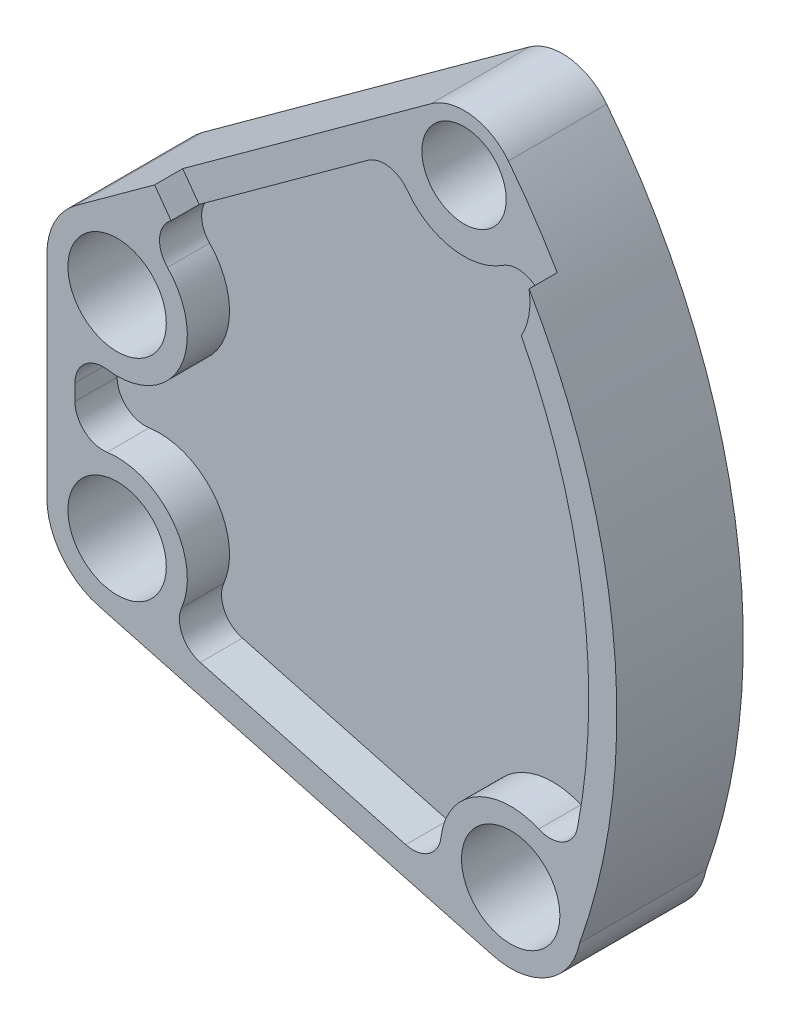
ISO-10303-21;
HEADER;
FILE_DESCRIPTION(('STEP AP214'),'2;1');
FILE_NAME('part.step','',(''),(''),'','','');
FILE_SCHEMA(('AUTOMOTIVE_DESIGN { 1 0 10303 214 1 1 1 1 }'));
ENDSEC;
DATA;
#1=APPLICATION_CONTEXT('core data for automotive mechanical design processes');
#2=APPLICATION_PROTOCOL_DEFINITION('international standard','automotive_design',2000,#1);
#3=PRODUCT_CONTEXT('',#1,'mechanical');
#4=PRODUCT('Part','Part','',(#3));
#5=PRODUCT_RELATED_PRODUCT_CATEGORY('part','',(#4));
#6=PRODUCT_DEFINITION_FORMATION('','',#4);
#7=PRODUCT_DEFINITION_CONTEXT('part definition',#1,'design');
#8=PRODUCT_DEFINITION('design','',#6,#7);
#9=PRODUCT_DEFINITION_SHAPE('','',#8);
#10=(LENGTH_UNIT() NAMED_UNIT(*) SI_UNIT(.MILLI.,.METRE.));
#11=(NAMED_UNIT(*) PLANE_ANGLE_UNIT() SI_UNIT($,.RADIAN.));
#12=(NAMED_UNIT(*) SI_UNIT($,.STERADIAN.) SOLID_ANGLE_UNIT());
#13=UNCERTAINTY_MEASURE_WITH_UNIT(LENGTH_MEASURE(1.E-05),#10,'distance_accuracy_value','');
#14=(GEOMETRIC_REPRESENTATION_CONTEXT(3) GLOBAL_UNCERTAINTY_ASSIGNED_CONTEXT((#13)) GLOBAL_UNIT_ASSIGNED_CONTEXT((#10,
#11,#12)) REPRESENTATION_CONTEXT('',''));
#15=CARTESIAN_POINT('',(0.,0.,0.));
#16=DIRECTION('',(0.,0.,1.));
#17=DIRECTION('',(1.,0.,0.));
#18=AXIS2_PLACEMENT_3D('',#15,#16,#17);
#19=CARTESIAN_POINT('',(-22.6524758424985,-16.4579870641893,14.));
#20=DIRECTION('',(0.,0.,1.));
#21=DIRECTION('',(-1.,0.,0.));
#22=AXIS2_PLACEMENT_3D('',#19,#20,#21);
#23=PLANE('',#22);
#24=CARTESIAN_POINT('',(-22.6524758424985,-16.4579870641893,14.));
#25=DIRECTION('',(0.,0.,1.));
#26=DIRECTION('',(1.,0.,0.));
#27=AXIS2_PLACEMENT_3D('',#24,#25,#26);
#28=CIRCLE('',#27,3.49999999999999);
#29=CARTESIAN_POINT('',(-19.1524758424986,-16.4579870641893,14.));
#30=VERTEX_POINT('',#29);
#31=EDGE_CURVE('E502',#30,#30,#28,.T.);
#32=ORIENTED_EDGE('',*,*,#31,.F.);
#33=EDGE_LOOP('',(#32));
#34=FACE_BOUND('',#33,.T.);
#35=CARTESIAN_POINT('',(-22.6524758424985,-31.4579870641893,14.));
#36=DIRECTION('',(0.,0.,1.));
#37=DIRECTION('',(1.,0.,0.));
#38=AXIS2_PLACEMENT_3D('',#35,#36,#37);
#39=CIRCLE('',#38,3.49999999999999);
#40=CARTESIAN_POINT('',(-19.1524758424986,-31.4579870641893,14.));
#41=VERTEX_POINT('',#40);
#42=EDGE_CURVE('E496',#41,#41,#39,.T.);
#43=ORIENTED_EDGE('',*,*,#42,.F.);
#44=EDGE_LOOP('',(#43));
#45=FACE_BOUND('',#44,.T.);
#46=DIRECTION('',(0.,1.,0.));
#47=VECTOR('',#46,1.);
#48=CARTESIAN_POINT('',(-27.6524758424986,-35.294622004084,14.));
#49=LINE('',#48,#47);
#50=CARTESIAN_POINT('',(-27.6524758424986,-31.4579870641893,14.));
#51=VERTEX_POINT('',#50);
#52=CARTESIAN_POINT('',(-27.6524758424986,-16.4579870641893,14.));
#53=VERTEX_POINT('',#52);
#54=EDGE_CURVE('E257',#51,#53,#49,.T.);
#55=ORIENTED_EDGE('',*,*,#54,.F.);
#56=CARTESIAN_POINT('',(-22.6524758424986,-31.4579870641893,14.));
#57=DIRECTION('',(0.,0.,-1.));
#58=DIRECTION('',(-1.,0.,0.));
#59=AXIS2_PLACEMENT_3D('',#56,#57,#58);
#60=CIRCLE('',#59,5.);
#61=CARTESIAN_POINT('',(-23.9465710680112,-36.2876161956346,14.));
#62=VERTEX_POINT('',#61);
#63=EDGE_CURVE('E388',#62,#51,#60,.T.);
#64=ORIENTED_EDGE('',*,*,#63,.F.);
#65=DIRECTION('',(-0.965925826289068,0.258819045102521,0.));
#66=VECTOR('',#65,1.);
#67=CARTESIAN_POINT('',(4.06527789437187,-43.7933685036077,14.));
#68=LINE('',#67,#66);
#69=CARTESIAN_POINT('',(4.06527789437187,-43.7933685036077,14.));
#70=VERTEX_POINT('',#69);
#71=EDGE_CURVE('E292',#70,#62,#68,.T.);
#72=ORIENTED_EDGE('',*,*,#71,.F.);
#73=CARTESIAN_POINT('',(5.35937311988446,-38.9637393721623,14.));
#74=DIRECTION('',(0.,0.,-1.));
#75=DIRECTION('',(-1.,0.,0.));
#76=AXIS2_PLACEMENT_3D('',#73,#74,#75);
#77=CIRCLE('',#76,5.00000000000001);
#78=CARTESIAN_POINT('',(10.2601455915492,-39.9549150281252,14.));
#79=VERTEX_POINT('',#78);
#80=EDGE_CURVE('E289',#79,#70,#77,.T.);
#81=ORIENTED_EDGE('',*,*,#80,.F.);
#82=CARTESIAN_POINT('',(-33.086664591222,-24.5583554455818,14.));
#83=DIRECTION('',(0.,0.,-1.));
#84=DIRECTION('',(-1.,0.,0.));
#85=AXIS2_PLACEMENT_3D('',#82,#83,#84);
#86=CIRCLE('',#85,46.);
#87=CARTESIAN_POINT('',(6.67035341824604,-1.42008586908067,14.));
#88=VERTEX_POINT('',#87);
#89=EDGE_CURVE('E286',#88,#79,#86,.T.);
#90=ORIENTED_EDGE('',*,*,#89,.F.);
#91=CARTESIAN_POINT('',(1.73025928211613,-2.1917528478837,14.));
#92=DIRECTION('',(0.,0.,1.));
#93=DIRECTION('',(1.,0.,0.));
#94=AXIS2_PLACEMENT_3D('',#91,#92,#93);
#95=CIRCLE('',#94,5.00000000000001);
#96=CARTESIAN_POINT('',(6.11949722855625,-4.58645329878153,14.));
#97=VERTEX_POINT('',#96);
#98=EDGE_CURVE('E284',#97,#88,#95,.T.);
#99=ORIENTED_EDGE('',*,*,#98,.F.);
#100=CARTESIAN_POINT('',(-33.086664591222,-24.5583554455818,14.));
#101=DIRECTION('',(0.,0.,1.));
#102=DIRECTION('',(1.,0.,0.));
#103=AXIS2_PLACEMENT_3D('',#100,#101,#102);
#104=CIRCLE('',#103,44.);
#105=CARTESIAN_POINT('',(10.1109107981021,-32.923131622125,14.));
#106=VERTEX_POINT('',#105);
#107=EDGE_CURVE('E244',#106,#97,#104,.T.);
#108=ORIENTED_EDGE('',*,*,#107,.F.);
#109=CARTESIAN_POINT('',(8.1473846440419,-32.5429145231912,14.));
#110=DIRECTION('',(0.,0.,-1.));
#111=DIRECTION('',(-1.,0.,0.));
#112=AXIS2_PLACEMENT_3D('',#109,#110,#111);
#113=CIRCLE('',#112,2.);
#114=CARTESIAN_POINT('',(7.35080992285406,-34.3774359086115,14.));
#115=VERTEX_POINT('',#114);
#116=EDGE_CURVE('E378',#115,#106,#113,.F.);
#117=ORIENTED_EDGE('',*,*,#116,.F.);
#118=CARTESIAN_POINT('',(5.35937311988446,-38.9637393721623,14.));
#119=DIRECTION('',(0.,0.,-1.));
#120=DIRECTION('',(-1.,0.,0.));
#121=AXIS2_PLACEMENT_3D('',#118,#119,#120);
#122=CIRCLE('',#121,4.99999999999999);
#123=CARTESIAN_POINT('',(0.394409209166627,-38.372864287843,14.));
#124=VERTEX_POINT('',#123);
#125=EDGE_CURVE('E280',#124,#115,#122,.T.);
#126=ORIENTED_EDGE('',*,*,#125,.F.);
#127=CARTESIAN_POINT('',(-1.59157635512051,-38.1365142541153,14.));
#128=DIRECTION('',(0.,0.,-1.));
#129=DIRECTION('',(-1.,0.,0.));
#130=AXIS2_PLACEMENT_3D('',#127,#128,#129);
#131=CIRCLE('',#130,2.);
#132=CARTESIAN_POINT('',(-2.10921444532555,-40.0683659066934,14.));
#133=VERTEX_POINT('',#132);
#134=EDGE_CURVE('E364',#133,#124,#131,.F.);
#135=ORIENTED_EDGE('',*,*,#134,.F.);
#136=DIRECTION('',(0.965925826289069,-0.25881904510252,0.));
#137=VECTOR('',#136,1.);
#138=CARTESIAN_POINT('',(-19.5652296726498,-35.3910407234665,14.));
#139=LINE('',#138,#137);
#140=CARTESIAN_POINT('',(-16.7368025479036,-36.1489154873926,14.));
#141=VERTEX_POINT('',#140);
#142=EDGE_CURVE('E277',#141,#133,#139,.T.);
#143=ORIENTED_EDGE('',*,*,#142,.F.);
#144=CARTESIAN_POINT('',(-16.2191644576986,-34.2170638348144,14.));
#145=DIRECTION('',(0.,0.,-1.));
#146=DIRECTION('',(-1.,0.,0.));
#147=AXIS2_PLACEMENT_3D('',#144,#145,#146);
#148=CIRCLE('',#147,2.);
#149=CARTESIAN_POINT('',(-18.0572534247843,-33.4287561860644,14.));
#150=VERTEX_POINT('',#149);
#151=EDGE_CURVE('E370',#150,#141,#148,.F.);
#152=ORIENTED_EDGE('',*,*,#151,.F.);
#153=CARTESIAN_POINT('',(-22.6524758424985,-31.4579870641893,14.));
#154=DIRECTION('',(0.,0.,-1.));
#155=DIRECTION('',(-1.,0.,0.));
#156=AXIS2_PLACEMENT_3D('',#153,#154,#155);
#157=CIRCLE('',#156,5.);
#158=CARTESIAN_POINT('',(-23.3667615567843,-26.5092704711353,14.));
#159=VERTEX_POINT('',#158);
#160=EDGE_CURVE('E274',#159,#150,#157,.T.);
#161=ORIENTED_EDGE('',*,*,#160,.F.);
#162=CARTESIAN_POINT('',(-23.6524758424985,-24.5297838339137,14.));
#163=DIRECTION('',(0.,0.,-1.));
#164=DIRECTION('',(-1.,0.,0.));
#165=AXIS2_PLACEMENT_3D('',#162,#163,#164);
#166=CIRCLE('',#165,2.);
#167=CARTESIAN_POINT('',(-25.6524758424985,-24.5297838339137,14.));
#168=VERTEX_POINT('',#167);
#169=EDGE_CURVE('E367',#168,#159,#166,.F.);
#170=ORIENTED_EDGE('',*,*,#169,.F.);
#171=DIRECTION('',(0.,-1.,0.));
#172=VECTOR('',#171,1.);
#173=CARTESIAN_POINT('',(-25.6524758424985,-20.4579870641892,14.));
#174=LINE('',#173,#172);
#175=CARTESIAN_POINT('',(-25.6524758424985,-23.3861902944648,14.));
#176=VERTEX_POINT('',#175);
#177=EDGE_CURVE('E271',#176,#168,#174,.T.);
#178=ORIENTED_EDGE('',*,*,#177,.F.);
#179=CARTESIAN_POINT('',(-23.6524758424985,-23.3861902944648,14.));
#180=DIRECTION('',(0.,0.,-1.));
#181=DIRECTION('',(-1.,0.,0.));
#182=AXIS2_PLACEMENT_3D('',#179,#180,#181);
#183=CIRCLE('',#182,2.);
#184=CARTESIAN_POINT('',(-23.3667615567843,-21.4067036572432,14.));
#185=VERTEX_POINT('',#184);
#186=EDGE_CURVE('E375',#185,#176,#183,.F.);
#187=ORIENTED_EDGE('',*,*,#186,.F.);
#188=CARTESIAN_POINT('',(-22.6524758424985,-16.4579870641893,14.));
#189=DIRECTION('',(0.,0.,-1.));
#190=DIRECTION('',(-1.,0.,0.));
#191=AXIS2_PLACEMENT_3D('',#188,#189,#190);
#192=CIRCLE('',#191,5.);
#193=CARTESIAN_POINT('',(-19.068726627153,-12.9713351513207,14.));
#194=VERTEX_POINT('',#193);
#195=EDGE_CURVE('E268',#194,#185,#192,.T.);
#196=ORIENTED_EDGE('',*,*,#195,.F.);
#197=CARTESIAN_POINT('',(-17.6352269410147,-11.5766743861733,14.));
#198=DIRECTION('',(0.,0.,-1.));
#199=DIRECTION('',(-1.,0.,0.));
#200=AXIS2_PLACEMENT_3D('',#197,#198,#199);
#201=CIRCLE('',#200,2.);
#202=CARTESIAN_POINT('',(-18.8107974455997,-9.9586403974234,14.));
#203=VERTEX_POINT('',#202);
#204=EDGE_CURVE('E381',#203,#194,#201,.F.);
#205=ORIENTED_EDGE('',*,*,#204,.F.);
#206=DIRECTION('',(0.587785252292464,-0.809016994374954,0.));
#207=VECTOR('',#206,1.);
#208=CARTESIAN_POINT('',(-19.9863679501846,-8.3406064086735,14.));
#209=LINE('',#208,#207);
#210=CARTESIAN_POINT('',(-19.9863679501846,-8.3406064086735,14.));
#211=VERTEX_POINT('',#210);
#212=EDGE_CURVE('E264',#211,#203,#209,.T.);
#213=ORIENTED_EDGE('',*,*,#212,.F.);
#214=DIRECTION('',(0.809016994374947,0.587785252292474,0.));
#215=VECTOR('',#214,1.);
#216=CARTESIAN_POINT('',(-27.6524758424986,-13.9103598167171,14.));
#217=LINE('',#216,#215);
#218=CARTESIAN_POINT('',(-25.5914021039609,-12.4129020923145,14.));
#219=VERTEX_POINT('',#218);
#220=EDGE_CURVE('E261',#219,#211,#217,.T.);
#221=ORIENTED_EDGE('',*,*,#220,.F.);
#222=CARTESIAN_POINT('',(-22.6524758424986,-16.4579870641893,14.));
#223=DIRECTION('',(0.,0.,-1.));
#224=DIRECTION('',(-1.,0.,0.));
#225=AXIS2_PLACEMENT_3D('',#222,#223,#224);
#226=CIRCLE('',#225,5.);
#227=EDGE_CURVE('E391',#53,#219,#226,.T.);
#228=ORIENTED_EDGE('',*,*,#227,.F.);
#229=EDGE_LOOP('',(#55,#64,#72,#81,#90,#99,#108,#117,#126,#135,#143,#152,#161,#170,#178,#187,
#196,#205,#213,#221,#228));
#230=FACE_BOUND('',#229,.T.);
#231=CARTESIAN_POINT('',(5.35937311988447,-38.9637393721623,14.));
#232=DIRECTION('',(0.,0.,1.));
#233=DIRECTION('',(1.,0.,0.));
#234=AXIS2_PLACEMENT_3D('',#231,#232,#233);
#235=CIRCLE('',#234,3.49999999999999);
#236=CARTESIAN_POINT('',(8.85937311988446,-38.9637393721623,14.));
#237=VERTEX_POINT('',#236);
#238=EDGE_CURVE('E470',#237,#237,#235,.T.);
#239=ORIENTED_EDGE('',*,*,#238,.F.);
#240=EDGE_LOOP('',(#239));
#241=FACE_BOUND('',#240,.T.);
#242=ADVANCED_FACE('F43',(#34,#45,#230,#241),#23,.T.);
#243=CARTESIAN_POINT('',(-27.6524758424986,-13.9103598167171,12.));
#244=DIRECTION('',(-0.587785252292474,0.809016994374947,0.));
#245=DIRECTION('',(-0.809016994374947,-0.587785252292474,0.));
#246=AXIS2_PLACEMENT_3D('',#243,#244,#245);
#247=PLANE('',#246);
#248=ORIENTED_EDGE('',*,*,#220,.T.);
#249=DIRECTION('',(0.,0.,1.));
#250=VECTOR('',#249,1.);
#251=CARTESIAN_POINT('',(-19.9863679501846,-8.3406064086735,12.));
#252=LINE('',#251,#250);
#253=CARTESIAN_POINT('',(-19.9863679501846,-8.3406064086735,12.));
#254=VERTEX_POINT('',#253);
#255=EDGE_CURVE('E253',#254,#211,#252,.T.);
#256=ORIENTED_EDGE('',*,*,#255,.F.);
#257=DIRECTION('',(-0.809016994374947,-0.587785252292474,0.));
#258=VECTOR('',#257,1.);
#259=CARTESIAN_POINT('',(-27.6524758424986,-13.9103598167171,12.));
#260=LINE('',#259,#258);
#261=CARTESIAN_POINT('',(-2.31334090109592,4.49959934107852,12.));
#262=VERTEX_POINT('',#261);
#263=EDGE_CURVE('E409',#262,#254,#260,.T.);
#264=ORIENTED_EDGE('',*,*,#263,.F.);
#265=DIRECTION('',(0.,0.,1.));
#266=VECTOR('',#265,1.);
#267=CARTESIAN_POINT('',(-2.31334090109592,4.49959934107852,5.00000000000001));
#268=LINE('',#267,#266);
#269=CARTESIAN_POINT('',(-2.31334090109592,4.49959934107852,5.00000000000001));
#270=VERTEX_POINT('',#269);
#271=EDGE_CURVE('E428',#270,#262,#268,.T.);
#272=ORIENTED_EDGE('',*,*,#271,.F.);
#273=DIRECTION('',(-0.809016994374947,-0.587785252292474,0.));
#274=VECTOR('',#273,1.);
#275=CARTESIAN_POINT('',(-27.6524758424986,-13.9103598167171,5.00000000000001));
#276=LINE('',#275,#274);
#277=CARTESIAN_POINT('',(-25.5914021039609,-12.4129020923145,5.00000000000001));
#278=VERTEX_POINT('',#277);
#279=EDGE_CURVE('E426',#270,#278,#276,.T.);
#280=ORIENTED_EDGE('',*,*,#279,.T.);
#281=DIRECTION('',(0.,0.,1.));
#282=VECTOR('',#281,1.);
#283=CARTESIAN_POINT('',(-25.5914021039609,-12.4129020923145,12.));
#284=LINE('',#283,#282);
#285=EDGE_CURVE('E394',#219,#278,#284,.F.);
#286=ORIENTED_EDGE('',*,*,#285,.F.);
#287=EDGE_LOOP('',(#248,#256,#264,#272,#280,#286));
#288=FACE_BOUND('',#287,.T.);
#289=ADVANCED_FACE('F446',(#288),#247,.T.);
#290=CARTESIAN_POINT('',(-27.6524758424986,-35.294622004084,12.));
#291=DIRECTION('',(-1.,0.,0.));
#292=DIRECTION('',(0.,-1.,0.));
#293=AXIS2_PLACEMENT_3D('',#290,#291,#292);
#294=PLANE('',#293);
#295=DIRECTION('',(0.,-1.,0.));
#296=VECTOR('',#295,1.);
#297=CARTESIAN_POINT('',(-27.6524758424986,-35.294622004084,5.00000000000001));
#298=LINE('',#297,#296);
#299=CARTESIAN_POINT('',(-27.6524758424986,-16.4579870641893,5.00000000000001));
#300=VERTEX_POINT('',#299);
#301=CARTESIAN_POINT('',(-27.6524758424986,-31.4579870641893,5.00000000000001));
#302=VERTEX_POINT('',#301);
#303=EDGE_CURVE('E404',#300,#302,#298,.T.);
#304=ORIENTED_EDGE('',*,*,#303,.T.);
#305=DIRECTION('',(0.,0.,1.));
#306=VECTOR('',#305,1.);
#307=CARTESIAN_POINT('',(-27.6524758424986,-31.4579870641893,12.));
#308=LINE('',#307,#306);
#309=EDGE_CURVE('E384',#51,#302,#308,.F.);
#310=ORIENTED_EDGE('',*,*,#309,.F.);
#311=ORIENTED_EDGE('',*,*,#54,.T.);
#312=DIRECTION('',(0.,0.,1.));
#313=VECTOR('',#312,1.);
#314=CARTESIAN_POINT('',(-27.6524758424986,-16.4579870641893,12.));
#315=LINE('',#314,#313);
#316=EDGE_CURVE('E386',#300,#53,#315,.T.);
#317=ORIENTED_EDGE('',*,*,#316,.F.);
#318=EDGE_LOOP('',(#304,#310,#311,#317));
#319=FACE_BOUND('',#318,.T.);
#320=ADVANCED_FACE('F403',(#319),#294,.T.);
#321=CARTESIAN_POINT('',(4.06527789437187,-43.7933685036077,12.));
#322=DIRECTION('',(-0.258819045102521,-0.965925826289068,0.));
#323=DIRECTION('',(0.965925826289068,-0.258819045102521,0.));
#324=AXIS2_PLACEMENT_3D('',#321,#322,#323);
#325=PLANE('',#324);
#326=DIRECTION('',(0.965925826289068,-0.25881904510252,0.));
#327=VECTOR('',#326,1.);
#328=CARTESIAN_POINT('',(4.06527789437186,-43.7933685036077,5.00000000000001));
#329=LINE('',#328,#327);
#330=CARTESIAN_POINT('',(-23.9465710680112,-36.2876161956346,5.00000000000001));
#331=VERTEX_POINT('',#330);
#332=CARTESIAN_POINT('',(4.06527789437186,-43.7933685036077,5.00000000000001));
#333=VERTEX_POINT('',#332);
#334=EDGE_CURVE('E408',#331,#333,#329,.T.);
#335=ORIENTED_EDGE('',*,*,#334,.T.);
#336=DIRECTION('',(0.,0.,1.));
#337=VECTOR('',#336,1.);
#338=CARTESIAN_POINT('',(4.06527789437187,-43.7933685036077,12.));
#339=LINE('',#338,#337);
#340=EDGE_CURVE('E297',#333,#70,#339,.T.);
#341=ORIENTED_EDGE('',*,*,#340,.T.);
#342=ORIENTED_EDGE('',*,*,#71,.T.);
#343=DIRECTION('',(0.,0.,1.));
#344=VECTOR('',#343,1.);
#345=CARTESIAN_POINT('',(-23.9465710680112,-36.2876161956346,12.));
#346=LINE('',#345,#344);
#347=EDGE_CURVE('E11',#331,#62,#346,.T.);
#348=ORIENTED_EDGE('',*,*,#347,.F.);
#349=EDGE_LOOP('',(#335,#341,#342,#348));
#350=FACE_BOUND('',#349,.T.);
#351=ADVANCED_FACE('F548',(#350),#325,.T.);
#352=CARTESIAN_POINT('',(5.35937311988446,-38.9637393721623,12.));
#353=DIRECTION('',(0.,0.,1.));
#354=DIRECTION('',(-1.,0.,0.));
#355=AXIS2_PLACEMENT_3D('',#352,#353,#354);
#356=CYLINDRICAL_SURFACE('',#355,5.00000000000001);
#357=ORIENTED_EDGE('',*,*,#80,.T.);
#358=ORIENTED_EDGE('',*,*,#340,.F.);
#359=CARTESIAN_POINT('',(5.35937311988446,-38.9637393721623,5.00000000000001));
#360=DIRECTION('',(0.,0.,1.));
#361=DIRECTION('',(-1.,0.,0.));
#362=AXIS2_PLACEMENT_3D('',#359,#360,#361);
#363=CIRCLE('',#362,5.);
#364=CARTESIAN_POINT('',(10.2601455915492,-39.9549150281252,5.00000000000001));
#365=VERTEX_POINT('',#364);
#366=EDGE_CURVE('E412',#333,#365,#363,.T.);
#367=ORIENTED_EDGE('',*,*,#366,.T.);
#368=DIRECTION('',(0.,0.,1.));
#369=VECTOR('',#368,1.);
#370=CARTESIAN_POINT('',(10.2601455915492,-39.9549150281252,12.));
#371=LINE('',#370,#369);
#372=EDGE_CURVE('E300',#365,#79,#371,.T.);
#373=ORIENTED_EDGE('',*,*,#372,.T.);
#374=EDGE_LOOP('',(#357,#358,#367,#373));
#375=FACE_BOUND('',#374,.T.);
#376=ADVANCED_FACE('F551',(#375),#356,.T.);
#377=CARTESIAN_POINT('',(-33.086664591222,-24.5583554455818,12.));
#378=DIRECTION('',(0.,0.,1.));
#379=DIRECTION('',(-1.,0.,0.));
#380=AXIS2_PLACEMENT_3D('',#377,#378,#379);
#381=CYLINDRICAL_SURFACE('',#380,46.);
#382=ORIENTED_EDGE('',*,*,#89,.T.);
#383=ORIENTED_EDGE('',*,*,#372,.F.);
#384=CARTESIAN_POINT('',(-33.086664591222,-24.5583554455818,5.00000000000001));
#385=DIRECTION('',(0.,0.,1.));
#386=DIRECTION('',(-1.,0.,0.));
#387=AXIS2_PLACEMENT_3D('',#384,#385,#386);
#388=CIRCLE('',#387,46.0000000000001);
#389=CARTESIAN_POINT('',(3.19251103181644,3.72275867873688,5.00000000000001));
#390=VERTEX_POINT('',#389);
#391=EDGE_CURVE('E421',#365,#390,#388,.T.);
#392=ORIENTED_EDGE('',*,*,#391,.T.);
#393=DIRECTION('',(0.,0.,1.));
#394=VECTOR('',#393,1.);
#395=CARTESIAN_POINT('',(3.19251103181644,3.72275867873688,5.00000000000001));
#396=LINE('',#395,#394);
#397=CARTESIAN_POINT('',(3.19251103181644,3.72275867873688,12.));
#398=VERTEX_POINT('',#397);
#399=EDGE_CURVE('E265',#390,#398,#396,.T.);
#400=ORIENTED_EDGE('',*,*,#399,.T.);
#401=CARTESIAN_POINT('',(-33.086664591222,-24.5583554455818,12.));
#402=DIRECTION('',(0.,0.,1.));
#403=DIRECTION('',(-1.,0.,0.));
#404=AXIS2_PLACEMENT_3D('',#401,#402,#403);
#405=CIRCLE('',#404,46.0000000000001);
#406=CARTESIAN_POINT('',(6.67035341824602,-1.42008586908064,12.));
#407=VERTEX_POINT('',#406);
#408=EDGE_CURVE('E429',#407,#398,#405,.T.);
#409=ORIENTED_EDGE('',*,*,#408,.F.);
#410=DIRECTION('',(0.,0.,1.));
#411=VECTOR('',#410,1.);
#412=CARTESIAN_POINT('',(6.67035341824604,-1.42008586908067,12.));
#413=LINE('',#412,#411);
#414=EDGE_CURVE('E248',#407,#88,#413,.T.);
#415=ORIENTED_EDGE('',*,*,#414,.T.);
#416=EDGE_LOOP('',(#382,#383,#392,#400,#409,#415));
#417=FACE_BOUND('',#416,.T.);
#418=ADVANCED_FACE('F437',(#417),#381,.T.);
#419=CARTESIAN_POINT('',(1.73025928211613,-2.1917528478837,12.));
#420=DIRECTION('',(0.,0.,1.));
#421=DIRECTION('',(-1.,0.,0.));
#422=AXIS2_PLACEMENT_3D('',#419,#420,#421);
#423=CYLINDRICAL_SURFACE('',#422,5.00000000000001);
#424=ORIENTED_EDGE('',*,*,#98,.T.);
#425=ORIENTED_EDGE('',*,*,#414,.F.);
#426=CARTESIAN_POINT('',(1.73025928211613,-2.1917528478837,12.));
#427=DIRECTION('',(0.,0.,1.));
#428=DIRECTION('',(1.,0.,0.));
#429=AXIS2_PLACEMENT_3D('',#426,#427,#428);
#430=CIRCLE('',#429,5.00000000000001);
#431=CARTESIAN_POINT('',(6.11949722855625,-4.58645329878153,12.));
#432=VERTEX_POINT('',#431);
#433=EDGE_CURVE('E228',#432,#407,#430,.T.);
#434=ORIENTED_EDGE('',*,*,#433,.F.);
#435=DIRECTION('',(0.,0.,1.));
#436=VECTOR('',#435,1.);
#437=CARTESIAN_POINT('',(6.11949722855625,-4.58645329878153,12.));
#438=LINE('',#437,#436);
#439=EDGE_CURVE('E240',#432,#97,#438,.T.);
#440=ORIENTED_EDGE('',*,*,#439,.T.);
#441=EDGE_LOOP('',(#424,#425,#434,#440));
#442=FACE_BOUND('',#441,.T.);
#443=ADVANCED_FACE('F251',(#442),#423,.F.);
#444=CARTESIAN_POINT('',(-33.086664591222,-24.5583554455818,12.));
#445=DIRECTION('',(0.,0.,1.));
#446=DIRECTION('',(-1.,0.,0.));
#447=AXIS2_PLACEMENT_3D('',#444,#445,#446);
#448=CYLINDRICAL_SURFACE('',#447,44.);
#449=CARTESIAN_POINT('',(-33.086664591222,-24.5583554455818,11.));
#450=DIRECTION('',(0.,0.,-1.));
#451=DIRECTION('',(-1.,0.,0.));
#452=AXIS2_PLACEMENT_3D('',#449,#450,#451);
#453=CIRCLE('',#452,44.);
#454=CARTESIAN_POINT('',(5.62608717983734,-3.64608989848374,11.));
#455=VERTEX_POINT('',#454);
#456=CARTESIAN_POINT('',(10.1109107981021,-32.923131622125,11.));
#457=VERTEX_POINT('',#456);
#458=EDGE_CURVE('E486',#455,#457,#453,.T.);
#459=ORIENTED_EDGE('',*,*,#458,.T.);
#460=DIRECTION('',(0.,0.,1.));
#461=VECTOR('',#460,1.);
#462=CARTESIAN_POINT('',(10.1109107981021,-32.923131622125,12.));
#463=LINE('',#462,#461);
#464=EDGE_CURVE('E306',#106,#457,#463,.F.);
#465=ORIENTED_EDGE('',*,*,#464,.F.);
#466=ORIENTED_EDGE('',*,*,#107,.T.);
#467=ORIENTED_EDGE('',*,*,#439,.F.);
#468=CARTESIAN_POINT('',(-33.086664591222,-24.5583554455818,12.));
#469=DIRECTION('',(0.,0.,-1.));
#470=DIRECTION('',(-1.,0.,0.));
#471=AXIS2_PLACEMENT_3D('',#468,#469,#470);
#472=CIRCLE('',#471,44.);
#473=CARTESIAN_POINT('',(5.62608717983734,-3.64608989848374,12.));
#474=VERTEX_POINT('',#473);
#475=EDGE_CURVE('E223',#474,#432,#472,.T.);
#476=ORIENTED_EDGE('',*,*,#475,.F.);
#477=DIRECTION('',(0.,0.,1.));
#478=VECTOR('',#477,1.);
#479=CARTESIAN_POINT('',(5.62608717983734,-3.64608989848374,12.));
#480=LINE('',#479,#478);
#481=EDGE_CURVE('E309',#455,#474,#480,.T.);
#482=ORIENTED_EDGE('',*,*,#481,.F.);
#483=EDGE_LOOP('',(#459,#465,#466,#467,#476,#482));
#484=FACE_BOUND('',#483,.T.);
#485=ADVANCED_FACE('F242',(#484),#448,.F.);
#486=CARTESIAN_POINT('',(5.35937311988446,-38.9637393721623,12.));
#487=DIRECTION('',(0.,0.,1.));
#488=DIRECTION('',(-1.,0.,0.));
#489=AXIS2_PLACEMENT_3D('',#486,#487,#488);
#490=CYLINDRICAL_SURFACE('',#489,4.99999999999999);
#491=ORIENTED_EDGE('',*,*,#125,.T.);
#492=DIRECTION('',(0.,0.,1.));
#493=VECTOR('',#492,1.);
#494=CARTESIAN_POINT('',(7.35080992285406,-34.3774359086115,12.));
#495=LINE('',#494,#493);
#496=CARTESIAN_POINT('',(7.35080992285406,-34.3774359086115,11.));
#497=VERTEX_POINT('',#496);
#498=EDGE_CURVE('E337',#497,#115,#495,.T.);
#499=ORIENTED_EDGE('',*,*,#498,.F.);
#500=CARTESIAN_POINT('',(5.35937311988446,-38.9637393721623,11.));
#501=DIRECTION('',(0.,0.,1.));
#502=DIRECTION('',(1.,0.,0.));
#503=AXIS2_PLACEMENT_3D('',#500,#501,#502);
#504=CIRCLE('',#503,4.99999999999999);
#505=CARTESIAN_POINT('',(0.39440920916662,-38.372864287843,11.));
#506=VERTEX_POINT('',#505);
#507=EDGE_CURVE('E483',#497,#506,#504,.T.);
#508=ORIENTED_EDGE('',*,*,#507,.T.);
#509=DIRECTION('',(0.,0.,1.));
#510=VECTOR('',#509,1.);
#511=CARTESIAN_POINT('',(0.394409209166627,-38.372864287843,12.));
#512=LINE('',#511,#510);
#513=EDGE_CURVE('E339',#124,#506,#512,.F.);
#514=ORIENTED_EDGE('',*,*,#513,.F.);
#515=EDGE_LOOP('',(#491,#499,#508,#514));
#516=FACE_BOUND('',#515,.T.);
#517=ADVANCED_FACE('F562',(#516),#490,.T.);
#518=CARTESIAN_POINT('',(-19.5652296726498,-35.3910407234665,12.));
#519=DIRECTION('',(0.25881904510252,0.965925826289069,0.));
#520=DIRECTION('',(-0.965925826289069,0.25881904510252,0.));
#521=AXIS2_PLACEMENT_3D('',#518,#519,#520);
#522=PLANE('',#521);
#523=DIRECTION('',(-0.965925826289069,0.25881904510252,0.));
#524=VECTOR('',#523,1.);
#525=CARTESIAN_POINT('',(0.719212679420629,-40.8262406706195,11.));
#526=LINE('',#525,#524);
#527=CARTESIAN_POINT('',(-2.10921444532555,-40.0683659066934,11.));
#528=VERTEX_POINT('',#527);
#529=CARTESIAN_POINT('',(-16.7368025479036,-36.1489154873926,11.));
#530=VERTEX_POINT('',#529);
#531=EDGE_CURVE('E480',#528,#530,#526,.T.);
#532=ORIENTED_EDGE('',*,*,#531,.T.);
#533=DIRECTION('',(0.,0.,-1.));
#534=VECTOR('',#533,1.);
#535=CARTESIAN_POINT('',(-16.7368025479036,-36.1489154873926,11.));
#536=LINE('',#535,#534);
#537=EDGE_CURVE('E332',#141,#530,#536,.T.);
#538=ORIENTED_EDGE('',*,*,#537,.F.);
#539=ORIENTED_EDGE('',*,*,#142,.T.);
#540=DIRECTION('',(0.,0.,-1.));
#541=VECTOR('',#540,1.);
#542=CARTESIAN_POINT('',(-2.10921444532555,-40.0683659066934,14.));
#543=LINE('',#542,#541);
#544=EDGE_CURVE('E335',#528,#133,#543,.F.);
#545=ORIENTED_EDGE('',*,*,#544,.F.);
#546=EDGE_LOOP('',(#532,#538,#539,#545));
#547=FACE_BOUND('',#546,.T.);
#548=ADVANCED_FACE('F565',(#547),#522,.T.);
#549=CARTESIAN_POINT('',(-22.6524758424985,-31.4579870641893,12.));
#550=DIRECTION('',(0.,0.,1.));
#551=DIRECTION('',(-1.,0.,0.));
#552=AXIS2_PLACEMENT_3D('',#549,#550,#551);
#553=CYLINDRICAL_SURFACE('',#552,5.);
#554=ORIENTED_EDGE('',*,*,#160,.T.);
#555=DIRECTION('',(0.,0.,1.));
#556=VECTOR('',#555,1.);
#557=CARTESIAN_POINT('',(-18.0572534247843,-33.4287561860644,12.));
#558=LINE('',#557,#556);
#559=CARTESIAN_POINT('',(-18.0572534247843,-33.4287561860644,11.));
#560=VERTEX_POINT('',#559);
#561=EDGE_CURVE('E347',#560,#150,#558,.T.);
#562=ORIENTED_EDGE('',*,*,#561,.F.);
#563=CARTESIAN_POINT('',(-22.6524758424985,-31.4579870641893,11.));
#564=DIRECTION('',(0.,0.,1.));
#565=DIRECTION('',(1.,0.,0.));
#566=AXIS2_PLACEMENT_3D('',#563,#564,#565);
#567=CIRCLE('',#566,5.);
#568=CARTESIAN_POINT('',(-23.3667615567843,-26.5092704711353,11.));
#569=VERTEX_POINT('',#568);
#570=EDGE_CURVE('E477',#560,#569,#567,.T.);
#571=ORIENTED_EDGE('',*,*,#570,.T.);
#572=DIRECTION('',(0.,0.,1.));
#573=VECTOR('',#572,1.);
#574=CARTESIAN_POINT('',(-23.3667615567843,-26.5092704711353,12.));
#575=LINE('',#574,#573);
#576=EDGE_CURVE('E349',#159,#569,#575,.F.);
#577=ORIENTED_EDGE('',*,*,#576,.F.);
#578=EDGE_LOOP('',(#554,#562,#571,#577));
#579=FACE_BOUND('',#578,.T.);
#580=ADVANCED_FACE('F569',(#579),#553,.T.);
#581=CARTESIAN_POINT('',(-25.6524758424985,-20.4579870641892,12.));
#582=DIRECTION('',(1.,0.,0.));
#583=DIRECTION('',(0.,0.,1.));
#584=AXIS2_PLACEMENT_3D('',#581,#582,#583);
#585=PLANE('',#584);
#586=DIRECTION('',(0.,1.,0.));
#587=VECTOR('',#586,1.);
#588=CARTESIAN_POINT('',(-25.6524758424986,-27.4579870641893,11.));
#589=LINE('',#588,#587);
#590=CARTESIAN_POINT('',(-25.6524758424986,-24.5297838339137,11.));
#591=VERTEX_POINT('',#590);
#592=CARTESIAN_POINT('',(-25.6524758424985,-23.3861902944648,11.));
#593=VERTEX_POINT('',#592);
#594=EDGE_CURVE('E431',#591,#593,#589,.T.);
#595=ORIENTED_EDGE('',*,*,#594,.T.);
#596=DIRECTION('',(0.,0.,-1.));
#597=VECTOR('',#596,1.);
#598=CARTESIAN_POINT('',(-25.6524758424985,-23.3861902944648,11.));
#599=LINE('',#598,#597);
#600=EDGE_CURVE('E342',#176,#593,#599,.T.);
#601=ORIENTED_EDGE('',*,*,#600,.F.);
#602=ORIENTED_EDGE('',*,*,#177,.T.);
#603=DIRECTION('',(0.,0.,-1.));
#604=VECTOR('',#603,1.);
#605=CARTESIAN_POINT('',(-25.6524758424985,-24.5297838339137,14.));
#606=LINE('',#605,#604);
#607=EDGE_CURVE('E345',#591,#168,#606,.F.);
#608=ORIENTED_EDGE('',*,*,#607,.F.);
#609=EDGE_LOOP('',(#595,#601,#602,#608));
#610=FACE_BOUND('',#609,.T.);
#611=ADVANCED_FACE('F573',(#610),#585,.T.);
#612=CARTESIAN_POINT('',(-22.6524758424985,-16.4579870641893,12.));
#613=DIRECTION('',(0.,0.,1.));
#614=DIRECTION('',(-1.,0.,0.));
#615=AXIS2_PLACEMENT_3D('',#612,#613,#614);
#616=CYLINDRICAL_SURFACE('',#615,5.);
#617=CARTESIAN_POINT('',(-22.6524758424985,-16.4579870641893,11.));
#618=DIRECTION('',(0.,0.,1.));
#619=DIRECTION('',(1.,0.,0.));
#620=AXIS2_PLACEMENT_3D('',#617,#618,#619);
#621=CIRCLE('',#620,5.);
#622=CARTESIAN_POINT('',(-23.3667615567843,-21.4067036572432,11.));
#623=VERTEX_POINT('',#622);
#624=CARTESIAN_POINT('',(-19.068726627153,-12.9713351513207,11.));
#625=VERTEX_POINT('',#624);
#626=EDGE_CURVE('E236',#623,#625,#621,.T.);
#627=ORIENTED_EDGE('',*,*,#626,.T.);
#628=DIRECTION('',(0.,0.,1.));
#629=VECTOR('',#628,1.);
#630=CARTESIAN_POINT('',(-19.068726627153,-12.9713351513207,12.));
#631=LINE('',#630,#629);
#632=EDGE_CURVE('E358',#194,#625,#631,.F.);
#633=ORIENTED_EDGE('',*,*,#632,.F.);
#634=ORIENTED_EDGE('',*,*,#195,.T.);
#635=DIRECTION('',(0.,0.,1.));
#636=VECTOR('',#635,1.);
#637=CARTESIAN_POINT('',(-23.3667615567843,-21.4067036572432,12.));
#638=LINE('',#637,#636);
#639=EDGE_CURVE('E361',#623,#185,#638,.T.);
#640=ORIENTED_EDGE('',*,*,#639,.F.);
#641=EDGE_LOOP('',(#627,#633,#634,#640));
#642=FACE_BOUND('',#641,.T.);
#643=ADVANCED_FACE('F577',(#642),#616,.T.);
#644=CARTESIAN_POINT('',(-18.8107974455997,-9.9586403974234,12.));
#645=DIRECTION('',(0.587785252292474,-0.809016994374947,0.));
#646=DIRECTION('',(0.809016994374947,0.587785252292474,0.));
#647=AXIS2_PLACEMENT_3D('',#644,#645,#646);
#648=PLANE('',#647);
#649=DIRECTION('',(0.809016994374947,0.587785252292474,0.));
#650=VECTOR('',#649,1.);
#651=CARTESIAN_POINT('',(-1.137770396511,2.88156535232865,12.));
#652=LINE('',#651,#650);
#653=CARTESIAN_POINT('',(-18.8107974455997,-9.9586403974234,12.));
#654=VERTEX_POINT('',#653);
#655=CARTESIAN_POINT('',(-6.80088935713562,-1.23293141371867,12.));
#656=VERTEX_POINT('',#655);
#657=EDGE_CURVE('E299',#654,#656,#652,.T.);
#658=ORIENTED_EDGE('',*,*,#657,.F.);
#659=DIRECTION('',(0.,0.,-1.));
#660=VECTOR('',#659,1.);
#661=CARTESIAN_POINT('',(-18.8107974455997,-9.9586403974234,14.));
#662=LINE('',#661,#660);
#663=CARTESIAN_POINT('',(-18.8107974455997,-9.9586403974234,11.));
#664=VERTEX_POINT('',#663);
#665=EDGE_CURVE('E352',#664,#654,#662,.F.);
#666=ORIENTED_EDGE('',*,*,#665,.F.);
#667=DIRECTION('',(0.809016994374947,0.587785252292474,0.));
#668=VECTOR('',#667,1.);
#669=CARTESIAN_POINT('',(-21.1797636218762,-11.6797950718945,11.));
#670=LINE('',#669,#668);
#671=CARTESIAN_POINT('',(-6.80088935713562,-1.23293141371867,11.));
#672=VERTEX_POINT('',#671);
#673=EDGE_CURVE('E490',#664,#672,#670,.T.);
#674=ORIENTED_EDGE('',*,*,#673,.T.);
#675=DIRECTION('',(0.,0.,1.));
#676=VECTOR('',#675,1.);
#677=CARTESIAN_POINT('',(-6.80088935713562,-1.23293141371867,12.));
#678=LINE('',#677,#676);
#679=EDGE_CURVE('E355',#656,#672,#678,.F.);
#680=ORIENTED_EDGE('',*,*,#679,.F.);
#681=EDGE_LOOP('',(#658,#666,#674,#680));
#682=FACE_BOUND('',#681,.T.);
#683=ADVANCED_FACE('F460',(#682),#648,.T.);
#684=CARTESIAN_POINT('',(-19.9863679501846,-8.3406064086735,12.));
#685=DIRECTION('',(0.809016994374954,0.587785252292464,0.));
#686=DIRECTION('',(-0.587785252292464,0.809016994374954,0.));
#687=AXIS2_PLACEMENT_3D('',#684,#685,#686);
#688=PLANE('',#687);
#689=ORIENTED_EDGE('',*,*,#212,.T.);
#690=DIRECTION('',(0.,0.,1.));
#691=VECTOR('',#690,1.);
#692=CARTESIAN_POINT('',(-18.8107974455997,-9.9586403974234,12.));
#693=LINE('',#692,#691);
#694=EDGE_CURVE('E249',#654,#203,#693,.T.);
#695=ORIENTED_EDGE('',*,*,#694,.F.);
#696=DIRECTION('',(0.587785252292464,-0.809016994374954,0.));
#697=VECTOR('',#696,1.);
#698=CARTESIAN_POINT('',(-19.9863679501846,-8.3406064086735,12.));
#699=LINE('',#698,#697);
#700=EDGE_CURVE('E254',#254,#654,#699,.T.);
#701=ORIENTED_EDGE('',*,*,#700,.F.);
#702=ORIENTED_EDGE('',*,*,#255,.T.);
#703=EDGE_LOOP('',(#689,#695,#701,#702));
#704=FACE_BOUND('',#703,.T.);
#705=ADVANCED_FACE('F450',(#704),#688,.T.);
#706=CARTESIAN_POINT('',(0.0378001080739705,1.26353136357874,12.));
#707=DIRECTION('',(0.,0.,1.));
#708=DIRECTION('',(-1.,0.,0.));
#709=AXIS2_PLACEMENT_3D('',#706,#707,#708);
#710=PLANE('',#709);
#711=CARTESIAN_POINT('',(0.0378001080739705,1.26353136357874,12.));
#712=DIRECTION('',(0.,0.,-1.));
#713=DIRECTION('',(-1.,0.,0.));
#714=AXIS2_PLACEMENT_3D('',#711,#712,#713);
#715=CIRCLE('',#714,2.99999999999999);
#716=CARTESIAN_POINT('',(-2.96219989192602,1.26353136357874,12.));
#717=VERTEX_POINT('',#716);
#718=EDGE_CURVE('E508',#717,#717,#715,.T.);
#719=ORIENTED_EDGE('',*,*,#718,.T.);
#720=EDGE_LOOP('',(#719));
#721=FACE_BOUND('',#720,.T.);
#722=ORIENTED_EDGE('',*,*,#475,.T.);
#723=ORIENTED_EDGE('',*,*,#433,.T.);
#724=ORIENTED_EDGE('',*,*,#408,.T.);
#725=CARTESIAN_POINT('',(0.0378001080739705,1.26353136357874,12.));
#726=DIRECTION('',(0.,0.,1.));
#727=DIRECTION('',(-1.,0.,0.));
#728=AXIS2_PLACEMENT_3D('',#725,#726,#727);
#729=CIRCLE('',#728,4.);
#730=EDGE_CURVE('E415',#398,#262,#729,.T.);
#731=ORIENTED_EDGE('',*,*,#730,.T.);
#732=ORIENTED_EDGE('',*,*,#263,.T.);
#733=ORIENTED_EDGE('',*,*,#700,.T.);
#734=ORIENTED_EDGE('',*,*,#657,.T.);
#735=CARTESIAN_POINT('',(-5.62531885255067,-2.85096540246856,12.));
#736=DIRECTION('',(0.,0.,-1.));
#737=DIRECTION('',(-1.,0.,0.));
#738=AXIS2_PLACEMENT_3D('',#735,#736,#737);
#739=CIRCLE('',#738,2.);
#740=CARTESIAN_POINT('',(-4.00728486380078,-1.67539489788362,12.));
#741=VERTEX_POINT('',#740);
#742=EDGE_CURVE('E373',#741,#656,#739,.F.);
#743=ORIENTED_EDGE('',*,*,#742,.F.);
#744=CARTESIAN_POINT('',(0.0378001080739705,1.26353136357874,12.));
#745=DIRECTION('',(0.,0.,1.));
#746=DIRECTION('',(-1.,0.,0.));
#747=AXIS2_PLACEMENT_3D('',#744,#745,#746);
#748=CIRCLE('',#747,5.);
#749=CARTESIAN_POINT('',(2.77252620572769,-2.92231062708594,12.));
#750=VERTEX_POINT('',#749);
#751=EDGE_CURVE('E237',#741,#750,#748,.T.);
#752=ORIENTED_EDGE('',*,*,#751,.T.);
#753=CARTESIAN_POINT('',(3.86641664478919,-4.59664742335184,12.));
#754=DIRECTION('',(0.,0.,-1.));
#755=DIRECTION('',(-1.,0.,0.));
#756=AXIS2_PLACEMENT_3D('',#753,#754,#755);
#757=CIRCLE('',#756,2.);
#758=EDGE_CURVE('E232',#474,#750,#757,.F.);
#759=ORIENTED_EDGE('',*,*,#758,.F.);
#760=EDGE_LOOP('',(#722,#723,#724,#731,#732,#733,#734,#743,#752,#759));
#761=FACE_BOUND('',#760,.T.);
#762=ADVANCED_FACE('F225',(#721,#761),#710,.T.);
#763=CARTESIAN_POINT('',(0.0378001080739705,1.26353136357874,5.00000000000001));
#764=DIRECTION('',(0.,0.,1.));
#765=DIRECTION('',(-1.,0.,0.));
#766=AXIS2_PLACEMENT_3D('',#763,#764,#765);
#767=CYLINDRICAL_SURFACE('',#766,4.);
#768=ORIENTED_EDGE('',*,*,#730,.F.);
#769=ORIENTED_EDGE('',*,*,#399,.F.);
#770=CARTESIAN_POINT('',(0.0378001080739705,1.26353136357874,5.00000000000001));
#771=DIRECTION('',(0.,0.,1.));
#772=DIRECTION('',(-1.,0.,0.));
#773=AXIS2_PLACEMENT_3D('',#770,#771,#772);
#774=CIRCLE('',#773,4.);
#775=EDGE_CURVE('E424',#390,#270,#774,.T.);
#776=ORIENTED_EDGE('',*,*,#775,.T.);
#777=ORIENTED_EDGE('',*,*,#271,.T.);
#778=EDGE_LOOP('',(#768,#769,#776,#777));
#779=FACE_BOUND('',#778,.T.);
#780=ADVANCED_FACE('F440',(#779),#767,.T.);
#781=CARTESIAN_POINT('',(0.0378001080739705,1.26353136357874,5.00000000000001));
#782=DIRECTION('',(0.,0.,1.));
#783=DIRECTION('',(-1.,0.,0.));
#784=AXIS2_PLACEMENT_3D('',#781,#782,#783);
#785=PLANE('',#784);
#786=CARTESIAN_POINT('',(0.0378001080739705,1.26353136357874,5.));
#787=DIRECTION('',(0.,0.,1.));
#788=DIRECTION('',(1.,0.,0.));
#789=AXIS2_PLACEMENT_3D('',#786,#787,#788);
#790=CIRCLE('',#789,2.99999999999999);
#791=CARTESIAN_POINT('',(3.03780010807396,1.26353136357874,5.));
#792=VERTEX_POINT('',#791);
#793=EDGE_CURVE('E511',#792,#792,#790,.T.);
#794=ORIENTED_EDGE('',*,*,#793,.T.);
#795=EDGE_LOOP('',(#794));
#796=FACE_BOUND('',#795,.T.);
#797=CARTESIAN_POINT('',(-22.6524758424985,-16.4579870641893,5.));
#798=DIRECTION('',(0.,0.,1.));
#799=DIRECTION('',(1.,0.,0.));
#800=AXIS2_PLACEMENT_3D('',#797,#798,#799);
#801=CIRCLE('',#800,3.49999999999999);
#802=CARTESIAN_POINT('',(-19.1524758424986,-16.4579870641893,5.));
#803=VERTEX_POINT('',#802);
#804=EDGE_CURVE('E505',#803,#803,#801,.T.);
#805=ORIENTED_EDGE('',*,*,#804,.T.);
#806=EDGE_LOOP('',(#805));
#807=FACE_BOUND('',#806,.T.);
#808=CARTESIAN_POINT('',(-22.6524758424985,-31.4579870641893,5.));
#809=DIRECTION('',(0.,0.,1.));
#810=DIRECTION('',(1.,0.,0.));
#811=AXIS2_PLACEMENT_3D('',#808,#809,#810);
#812=CIRCLE('',#811,3.49999999999999);
#813=CARTESIAN_POINT('',(-19.1524758424986,-31.4579870641893,5.));
#814=VERTEX_POINT('',#813);
#815=EDGE_CURVE('E499',#814,#814,#812,.T.);
#816=ORIENTED_EDGE('',*,*,#815,.T.);
#817=EDGE_LOOP('',(#816));
#818=FACE_BOUND('',#817,.T.);
#819=CARTESIAN_POINT('',(5.35937311988447,-38.9637393721623,5.));
#820=DIRECTION('',(0.,0.,1.));
#821=DIRECTION('',(1.,0.,0.));
#822=AXIS2_PLACEMENT_3D('',#819,#820,#821);
#823=CIRCLE('',#822,3.49999999999999);
#824=CARTESIAN_POINT('',(8.85937311988446,-38.9637393721623,5.));
#825=VERTEX_POINT('',#824);
#826=EDGE_CURVE('E472',#825,#825,#823,.T.);
#827=ORIENTED_EDGE('',*,*,#826,.T.);
#828=EDGE_LOOP('',(#827));
#829=FACE_BOUND('',#828,.T.);
#830=ORIENTED_EDGE('',*,*,#279,.F.);
#831=ORIENTED_EDGE('',*,*,#775,.F.);
#832=ORIENTED_EDGE('',*,*,#391,.F.);
#833=ORIENTED_EDGE('',*,*,#366,.F.);
#834=ORIENTED_EDGE('',*,*,#334,.F.);
#835=CARTESIAN_POINT('',(-22.6524758424986,-31.4579870641893,5.00000000000001));
#836=DIRECTION('',(0.,0.,-1.));
#837=DIRECTION('',(-1.,0.,0.));
#838=AXIS2_PLACEMENT_3D('',#835,#836,#837);
#839=CIRCLE('',#838,5.);
#840=EDGE_CURVE('E57',#302,#331,#839,.F.);
#841=ORIENTED_EDGE('',*,*,#840,.F.);
#842=ORIENTED_EDGE('',*,*,#303,.F.);
#843=CARTESIAN_POINT('',(-22.6524758424986,-16.4579870641893,5.00000000000001));
#844=DIRECTION('',(0.,0.,-1.));
#845=DIRECTION('',(-1.,0.,0.));
#846=AXIS2_PLACEMENT_3D('',#843,#844,#845);
#847=CIRCLE('',#846,5.);
#848=EDGE_CURVE('E51',#278,#300,#847,.F.);
#849=ORIENTED_EDGE('',*,*,#848,.F.);
#850=EDGE_LOOP('',(#830,#831,#832,#833,#834,#841,#842,#849));
#851=FACE_BOUND('',#850,.T.);
#852=ADVANCED_FACE('F406',(#796,#807,#818,#829,#851),#785,.F.);
#853=CARTESIAN_POINT('',(0.0378001080739705,1.26353136357874,11.));
#854=DIRECTION('',(0.,0.,1.));
#855=DIRECTION('',(-1.,0.,0.));
#856=AXIS2_PLACEMENT_3D('',#853,#854,#855);
#857=CYLINDRICAL_SURFACE('',#856,5.);
#858=ORIENTED_EDGE('',*,*,#751,.F.);
#859=DIRECTION('',(0.,0.,1.));
#860=VECTOR('',#859,1.);
#861=CARTESIAN_POINT('',(-4.00728486380078,-1.67539489788362,11.));
#862=LINE('',#861,#860);
#863=CARTESIAN_POINT('',(-4.00728486380078,-1.67539489788362,11.));
#864=VERTEX_POINT('',#863);
#865=EDGE_CURVE('E311',#864,#741,#862,.T.);
#866=ORIENTED_EDGE('',*,*,#865,.F.);
#867=CARTESIAN_POINT('',(0.0378001080739705,1.26353136357874,11.));
#868=DIRECTION('',(0.,0.,1.));
#869=DIRECTION('',(-1.,0.,0.));
#870=AXIS2_PLACEMENT_3D('',#867,#868,#869);
#871=CIRCLE('',#870,5.);
#872=CARTESIAN_POINT('',(2.77252620572769,-2.92231062708594,11.));
#873=VERTEX_POINT('',#872);
#874=EDGE_CURVE('E488',#864,#873,#871,.T.);
#875=ORIENTED_EDGE('',*,*,#874,.T.);
#876=DIRECTION('',(0.,0.,1.));
#877=VECTOR('',#876,1.);
#878=CARTESIAN_POINT('',(2.77252620572769,-2.92231062708594,11.));
#879=LINE('',#878,#877);
#880=EDGE_CURVE('E313',#750,#873,#879,.F.);
#881=ORIENTED_EDGE('',*,*,#880,.F.);
#882=EDGE_LOOP('',(#858,#866,#875,#881));
#883=FACE_BOUND('',#882,.T.);
#884=ADVANCED_FACE('F469',(#883),#857,.T.);
#885=CARTESIAN_POINT('',(-22.6524758424985,-16.4579870641893,11.));
#886=DIRECTION('',(0.,0.,-1.));
#887=DIRECTION('',(1.,0.,0.));
#888=AXIS2_PLACEMENT_3D('',#885,#886,#887);
#889=PLANE('',#888);
#890=ORIENTED_EDGE('',*,*,#874,.F.);
#891=CARTESIAN_POINT('',(-5.62531885255067,-2.85096540246856,11.));
#892=DIRECTION('',(0.,0.,1.));
#893=DIRECTION('',(1.,0.,0.));
#894=AXIS2_PLACEMENT_3D('',#891,#892,#893);
#895=CIRCLE('',#894,2.);
#896=EDGE_CURVE('E322',#672,#864,#895,.F.);
#897=ORIENTED_EDGE('',*,*,#896,.F.);
#898=ORIENTED_EDGE('',*,*,#673,.F.);
#899=CARTESIAN_POINT('',(-17.6352269410147,-11.5766743861733,11.));
#900=DIRECTION('',(0.,0.,1.));
#901=DIRECTION('',(1.,0.,0.));
#902=AXIS2_PLACEMENT_3D('',#899,#900,#901);
#903=CIRCLE('',#902,2.);
#904=EDGE_CURVE('E316',#625,#664,#903,.F.);
#905=ORIENTED_EDGE('',*,*,#904,.F.);
#906=ORIENTED_EDGE('',*,*,#626,.F.);
#907=CARTESIAN_POINT('',(-23.6524758424985,-23.3861902944648,11.));
#908=DIRECTION('',(0.,0.,1.));
#909=DIRECTION('',(1.,0.,0.));
#910=AXIS2_PLACEMENT_3D('',#907,#908,#909);
#911=CIRCLE('',#910,2.);
#912=EDGE_CURVE('E320',#593,#623,#911,.F.);
#913=ORIENTED_EDGE('',*,*,#912,.F.);
#914=ORIENTED_EDGE('',*,*,#594,.F.);
#915=CARTESIAN_POINT('',(-23.6524758424985,-24.5297838339137,11.));
#916=DIRECTION('',(0.,0.,1.));
#917=DIRECTION('',(1.,0.,0.));
#918=AXIS2_PLACEMENT_3D('',#915,#916,#917);
#919=CIRCLE('',#918,2.);
#920=EDGE_CURVE('E326',#569,#591,#919,.F.);
#921=ORIENTED_EDGE('',*,*,#920,.F.);
#922=ORIENTED_EDGE('',*,*,#570,.F.);
#923=CARTESIAN_POINT('',(-16.2191644576986,-34.2170638348144,11.));
#924=DIRECTION('',(0.,0.,1.));
#925=DIRECTION('',(1.,0.,0.));
#926=AXIS2_PLACEMENT_3D('',#923,#924,#925);
#927=CIRCLE('',#926,2.);
#928=EDGE_CURVE('E324',#530,#560,#927,.F.);
#929=ORIENTED_EDGE('',*,*,#928,.F.);
#930=ORIENTED_EDGE('',*,*,#531,.F.);
#931=CARTESIAN_POINT('',(-1.59157635512051,-38.1365142541153,11.));
#932=DIRECTION('',(0.,0.,1.));
#933=DIRECTION('',(1.,0.,0.));
#934=AXIS2_PLACEMENT_3D('',#931,#932,#933);
#935=CIRCLE('',#934,2.);
#936=EDGE_CURVE('E328',#506,#528,#935,.F.);
#937=ORIENTED_EDGE('',*,*,#936,.F.);
#938=ORIENTED_EDGE('',*,*,#507,.F.);
#939=CARTESIAN_POINT('',(8.1473846440419,-32.5429145231912,11.));
#940=DIRECTION('',(0.,0.,1.));
#941=DIRECTION('',(1.,0.,0.));
#942=AXIS2_PLACEMENT_3D('',#939,#940,#941);
#943=CIRCLE('',#942,2.);
#944=EDGE_CURVE('E318',#457,#497,#943,.F.);
#945=ORIENTED_EDGE('',*,*,#944,.F.);
#946=ORIENTED_EDGE('',*,*,#458,.F.);
#947=CARTESIAN_POINT('',(3.86641664478919,-4.59664742335184,11.));
#948=DIRECTION('',(0.,0.,1.));
#949=DIRECTION('',(1.,0.,0.));
#950=AXIS2_PLACEMENT_3D('',#947,#948,#949);
#951=CIRCLE('',#950,2.);
#952=EDGE_CURVE('E330',#873,#455,#951,.F.);
#953=ORIENTED_EDGE('',*,*,#952,.F.);
#954=EDGE_LOOP('',(#890,#897,#898,#905,#906,#913,#914,#921,#922,#929,#930,#937,#938,#945,#946,#953));
#955=FACE_BOUND('',#954,.T.);
#956=ADVANCED_FACE('F702',(#955),#889,.F.);
#957=CARTESIAN_POINT('',(5.35937311988447,-38.9637393721623,5.00000000000001));
#958=DIRECTION('',(0.,0.,-1.));
#959=DIRECTION('',(1.,0.,0.));
#960=AXIS2_PLACEMENT_3D('',#957,#958,#959);
#961=CYLINDRICAL_SURFACE('',#960,3.49999999999999);
#962=ORIENTED_EDGE('',*,*,#238,.T.);
#963=EDGE_LOOP('',(#962));
#964=FACE_BOUND('',#963,.T.);
#965=ORIENTED_EDGE('',*,*,#826,.F.);
#966=EDGE_LOOP('',(#965));
#967=FACE_BOUND('',#966,.T.);
#968=ADVANCED_FACE('F691',(#964,#967),#961,.F.);
#969=CARTESIAN_POINT('',(-22.6524758424985,-31.4579870641893,5.00000000000001));
#970=DIRECTION('',(0.,0.,-1.));
#971=DIRECTION('',(1.,0.,0.));
#972=AXIS2_PLACEMENT_3D('',#969,#970,#971);
#973=CYLINDRICAL_SURFACE('',#972,3.49999999999999);
#974=ORIENTED_EDGE('',*,*,#42,.T.);
#975=EDGE_LOOP('',(#974));
#976=FACE_BOUND('',#975,.T.);
#977=ORIENTED_EDGE('',*,*,#815,.F.);
#978=EDGE_LOOP('',(#977));
#979=FACE_BOUND('',#978,.T.);
#980=ADVANCED_FACE('F530',(#976,#979),#973,.F.);
#981=CARTESIAN_POINT('',(-22.6524758424985,-16.4579870641893,5.00000000000001));
#982=DIRECTION('',(0.,0.,-1.));
#983=DIRECTION('',(1.,0.,0.));
#984=AXIS2_PLACEMENT_3D('',#981,#982,#983);
#985=CYLINDRICAL_SURFACE('',#984,3.49999999999999);
#986=ORIENTED_EDGE('',*,*,#31,.T.);
#987=EDGE_LOOP('',(#986));
#988=FACE_BOUND('',#987,.T.);
#989=ORIENTED_EDGE('',*,*,#804,.F.);
#990=EDGE_LOOP('',(#989));
#991=FACE_BOUND('',#990,.T.);
#992=ADVANCED_FACE('F520',(#988,#991),#985,.F.);
#993=CARTESIAN_POINT('',(0.0378001080739705,1.26353136357874,5.00000000000001));
#994=DIRECTION('',(0.,0.,-1.));
#995=DIRECTION('',(1.,0.,0.));
#996=AXIS2_PLACEMENT_3D('',#993,#994,#995);
#997=CYLINDRICAL_SURFACE('',#996,2.99999999999999);
#998=ORIENTED_EDGE('',*,*,#718,.F.);
#999=EDGE_LOOP('',(#998));
#1000=FACE_BOUND('',#999,.T.);
#1001=ORIENTED_EDGE('',*,*,#793,.F.);
#1002=EDGE_LOOP('',(#1001));
#1003=FACE_BOUND('',#1002,.T.);
#1004=ADVANCED_FACE('F517',(#1000,#1003),#997,.F.);
#1005=CARTESIAN_POINT('',(3.86641664478919,-4.59664742335184,11.));
#1006=DIRECTION('',(0.,0.,1.));
#1007=DIRECTION('',(-1.,0.,0.));
#1008=AXIS2_PLACEMENT_3D('',#1005,#1006,#1007);
#1009=CYLINDRICAL_SURFACE('',#1008,2.);
#1010=ORIENTED_EDGE('',*,*,#952,.T.);
#1011=ORIENTED_EDGE('',*,*,#481,.T.);
#1012=ORIENTED_EDGE('',*,*,#758,.T.);
#1013=ORIENTED_EDGE('',*,*,#880,.T.);
#1014=EDGE_LOOP('',(#1010,#1011,#1012,#1013));
#1015=FACE_BOUND('',#1014,.T.);
#1016=ADVANCED_FACE('F519',(#1015),#1009,.F.);
#1017=CARTESIAN_POINT('',(-1.59157635512051,-38.1365142541153,12.));
#1018=DIRECTION('',(0.,0.,1.));
#1019=DIRECTION('',(-1.,0.,0.));
#1020=AXIS2_PLACEMENT_3D('',#1017,#1018,#1019);
#1021=CYLINDRICAL_SURFACE('',#1020,2.);
#1022=ORIENTED_EDGE('',*,*,#936,.T.);
#1023=ORIENTED_EDGE('',*,*,#544,.T.);
#1024=ORIENTED_EDGE('',*,*,#134,.T.);
#1025=ORIENTED_EDGE('',*,*,#513,.T.);
#1026=EDGE_LOOP('',(#1022,#1023,#1024,#1025));
#1027=FACE_BOUND('',#1026,.T.);
#1028=ADVANCED_FACE('F527',(#1027),#1021,.F.);
#1029=CARTESIAN_POINT('',(-23.6524758424985,-24.5297838339137,12.));
#1030=DIRECTION('',(0.,0.,1.));
#1031=DIRECTION('',(-1.,0.,0.));
#1032=AXIS2_PLACEMENT_3D('',#1029,#1030,#1031);
#1033=CYLINDRICAL_SURFACE('',#1032,2.);
#1034=ORIENTED_EDGE('',*,*,#920,.T.);
#1035=ORIENTED_EDGE('',*,*,#607,.T.);
#1036=ORIENTED_EDGE('',*,*,#169,.T.);
#1037=ORIENTED_EDGE('',*,*,#576,.T.);
#1038=EDGE_LOOP('',(#1034,#1035,#1036,#1037));
#1039=FACE_BOUND('',#1038,.T.);
#1040=ADVANCED_FACE('F588',(#1039),#1033,.F.);
#1041=CARTESIAN_POINT('',(-16.2191644576986,-34.2170638348144,12.));
#1042=DIRECTION('',(0.,0.,1.));
#1043=DIRECTION('',(-1.,0.,0.));
#1044=AXIS2_PLACEMENT_3D('',#1041,#1042,#1043);
#1045=CYLINDRICAL_SURFACE('',#1044,2.);
#1046=ORIENTED_EDGE('',*,*,#928,.T.);
#1047=ORIENTED_EDGE('',*,*,#561,.T.);
#1048=ORIENTED_EDGE('',*,*,#151,.T.);
#1049=ORIENTED_EDGE('',*,*,#537,.T.);
#1050=EDGE_LOOP('',(#1046,#1047,#1048,#1049));
#1051=FACE_BOUND('',#1050,.T.);
#1052=ADVANCED_FACE('F592',(#1051),#1045,.F.);
#1053=CARTESIAN_POINT('',(-5.62531885255067,-2.85096540246856,11.));
#1054=DIRECTION('',(0.,0.,1.));
#1055=DIRECTION('',(-1.,0.,0.));
#1056=AXIS2_PLACEMENT_3D('',#1053,#1054,#1055);
#1057=CYLINDRICAL_SURFACE('',#1056,2.);
#1058=ORIENTED_EDGE('',*,*,#896,.T.);
#1059=ORIENTED_EDGE('',*,*,#865,.T.);
#1060=ORIENTED_EDGE('',*,*,#742,.T.);
#1061=ORIENTED_EDGE('',*,*,#679,.T.);
#1062=EDGE_LOOP('',(#1058,#1059,#1060,#1061));
#1063=FACE_BOUND('',#1062,.T.);
#1064=ADVANCED_FACE('F464',(#1063),#1057,.F.);
#1065=CARTESIAN_POINT('',(-23.6524758424985,-23.3861902944648,12.));
#1066=DIRECTION('',(0.,0.,1.));
#1067=DIRECTION('',(-1.,0.,0.));
#1068=AXIS2_PLACEMENT_3D('',#1065,#1066,#1067);
#1069=CYLINDRICAL_SURFACE('',#1068,2.);
#1070=ORIENTED_EDGE('',*,*,#912,.T.);
#1071=ORIENTED_EDGE('',*,*,#639,.T.);
#1072=ORIENTED_EDGE('',*,*,#186,.T.);
#1073=ORIENTED_EDGE('',*,*,#600,.T.);
#1074=EDGE_LOOP('',(#1070,#1071,#1072,#1073));
#1075=FACE_BOUND('',#1074,.T.);
#1076=ADVANCED_FACE('F599',(#1075),#1069,.F.);
#1077=CARTESIAN_POINT('',(8.1473846440419,-32.5429145231912,12.));
#1078=DIRECTION('',(0.,0.,1.));
#1079=DIRECTION('',(-1.,0.,0.));
#1080=AXIS2_PLACEMENT_3D('',#1077,#1078,#1079);
#1081=CYLINDRICAL_SURFACE('',#1080,2.);
#1082=ORIENTED_EDGE('',*,*,#944,.T.);
#1083=ORIENTED_EDGE('',*,*,#498,.T.);
#1084=ORIENTED_EDGE('',*,*,#116,.T.);
#1085=ORIENTED_EDGE('',*,*,#464,.T.);
#1086=EDGE_LOOP('',(#1082,#1083,#1084,#1085));
#1087=FACE_BOUND('',#1086,.T.);
#1088=ADVANCED_FACE('F602',(#1087),#1081,.F.);
#1089=CARTESIAN_POINT('',(-17.6352269410147,-11.5766743861733,12.));
#1090=DIRECTION('',(0.,0.,1.));
#1091=DIRECTION('',(-1.,0.,0.));
#1092=AXIS2_PLACEMENT_3D('',#1089,#1090,#1091);
#1093=CYLINDRICAL_SURFACE('',#1092,2.);
#1094=ORIENTED_EDGE('',*,*,#904,.T.);
#1095=ORIENTED_EDGE('',*,*,#665,.T.);
#1096=ORIENTED_EDGE('',*,*,#694,.T.);
#1097=ORIENTED_EDGE('',*,*,#204,.T.);
#1098=ORIENTED_EDGE('',*,*,#632,.T.);
#1099=EDGE_LOOP('',(#1094,#1095,#1096,#1097,#1098));
#1100=FACE_BOUND('',#1099,.T.);
#1101=ADVANCED_FACE('F455',(#1100),#1093,.F.);
#1102=CARTESIAN_POINT('',(-22.6524758424986,-16.4579870641893,12.));
#1103=DIRECTION('',(0.,0.,1.));
#1104=DIRECTION('',(-1.,0.,0.));
#1105=AXIS2_PLACEMENT_3D('',#1102,#1103,#1104);
#1106=CYLINDRICAL_SURFACE('',#1105,5.);
#1107=ORIENTED_EDGE('',*,*,#848,.T.);
#1108=ORIENTED_EDGE('',*,*,#316,.T.);
#1109=ORIENTED_EDGE('',*,*,#227,.T.);
#1110=ORIENTED_EDGE('',*,*,#285,.T.);
#1111=EDGE_LOOP('',(#1107,#1108,#1109,#1110));
#1112=FACE_BOUND('',#1111,.T.);
#1113=ADVANCED_FACE('F398',(#1112),#1106,.T.);
#1114=CARTESIAN_POINT('',(-22.6524758424986,-31.4579870641893,12.));
#1115=DIRECTION('',(0.,0.,1.));
#1116=DIRECTION('',(-1.,0.,0.));
#1117=AXIS2_PLACEMENT_3D('',#1114,#1115,#1116);
#1118=CYLINDRICAL_SURFACE('',#1117,5.);
#1119=ORIENTED_EDGE('',*,*,#840,.T.);
#1120=ORIENTED_EDGE('',*,*,#347,.T.);
#1121=ORIENTED_EDGE('',*,*,#63,.T.);
#1122=ORIENTED_EDGE('',*,*,#309,.T.);
#1123=EDGE_LOOP('',(#1119,#1120,#1121,#1122));
#1124=FACE_BOUND('',#1123,.T.);
#1125=ADVANCED_FACE('F45',(#1124),#1118,.T.);
#1126=CLOSED_SHELL('',(#242,#289,#320,#351,#376,#418,#443,#485,#517,#548,#580,#611,#643,#683,
#705,#762,#780,#852,#884,#956,#968,#980,#992,#1004,#1016,#1028,#1040,#1052,#1064,#1076,#1088,
#1101,#1113,#1125));
#1127=MANIFOLD_SOLID_BREP('B2',#1126);
#1128=ADVANCED_BREP_SHAPE_REPRESENTATION('',(#18,#1127),#14);
#1129=SHAPE_DEFINITION_REPRESENTATION(#9,#1128);
ENDSEC;
END-ISO-10303-21;
